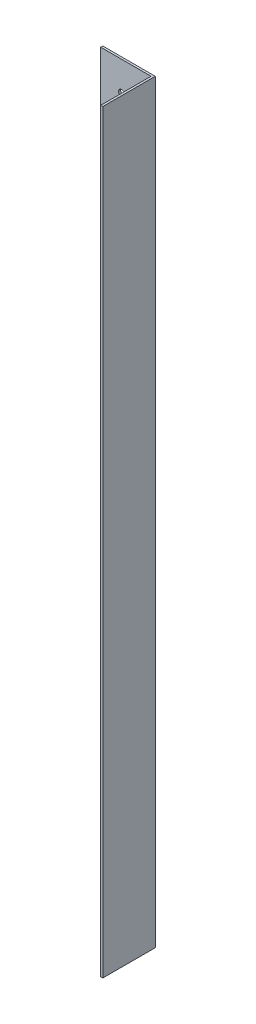
ISO-10303-21;
HEADER;
FILE_DESCRIPTION(('STEP AP214'),'2;1');
FILE_NAME('part.step','',(''),(''),'','','');
FILE_SCHEMA(('AUTOMOTIVE_DESIGN { 1 0 10303 214 1 1 1 1 }'));
ENDSEC;
DATA;
#1=APPLICATION_CONTEXT('core data for automotive mechanical design processes');
#2=APPLICATION_PROTOCOL_DEFINITION('international standard','automotive_design',2000,#1);
#3=PRODUCT_CONTEXT('',#1,'mechanical');
#4=PRODUCT('Part','Part','',(#3));
#5=PRODUCT_RELATED_PRODUCT_CATEGORY('part','',(#4));
#6=PRODUCT_DEFINITION_FORMATION('','',#4);
#7=PRODUCT_DEFINITION_CONTEXT('part definition',#1,'design');
#8=PRODUCT_DEFINITION('design','',#6,#7);
#9=PRODUCT_DEFINITION_SHAPE('','',#8);
#10=(LENGTH_UNIT() NAMED_UNIT(*) SI_UNIT(.MILLI.,.METRE.));
#11=(NAMED_UNIT(*) PLANE_ANGLE_UNIT() SI_UNIT($,.RADIAN.));
#12=(NAMED_UNIT(*) SI_UNIT($,.STERADIAN.) SOLID_ANGLE_UNIT());
#13=UNCERTAINTY_MEASURE_WITH_UNIT(LENGTH_MEASURE(1.E-05),#10,'distance_accuracy_value','');
#14=(GEOMETRIC_REPRESENTATION_CONTEXT(3) GLOBAL_UNCERTAINTY_ASSIGNED_CONTEXT((#13)) GLOBAL_UNIT_ASSIGNED_CONTEXT((#10,
#11,#12)) REPRESENTATION_CONTEXT('',''));
#15=CARTESIAN_POINT('',(0.,0.,0.));
#16=DIRECTION('',(0.,0.,1.));
#17=DIRECTION('',(1.,0.,0.));
#18=AXIS2_PLACEMENT_3D('',#15,#16,#17);
#19=CARTESIAN_POINT('',(0.,0.,1.));
#20=DIRECTION('',(0.,0.,1.));
#21=DIRECTION('',(1.,0.,0.));
#22=AXIS2_PLACEMENT_3D('',#19,#20,#21);
#23=PLANE('',#22);
#24=CARTESIAN_POINT('',(-43.4017250423012,12.4851945854484,1.));
#25=DIRECTION('',(0.,0.,1.));
#26=DIRECTION('',(1.,0.,0.));
#27=AXIS2_PLACEMENT_3D('',#24,#25,#26);
#28=CIRCLE('',#27,1.5);
#29=CARTESIAN_POINT('',(-41.9017250423012,12.4851945854484,1.));
#30=VERTEX_POINT('',#29);
#31=EDGE_CURVE('E97',#30,#30,#28,.T.);
#32=ORIENTED_EDGE('',*,*,#31,.F.);
#33=EDGE_LOOP('',(#32));
#34=FACE_BOUND('',#33,.T.);
#35=DIRECTION('',(0.,-1.,0.));
#36=VECTOR('',#35,1.);
#37=CARTESIAN_POINT('',(-53.4017250423012,26.4851945854484,1.));
#38=LINE('',#37,#36);
#39=CARTESIAN_POINT('',(-53.4017250423012,26.4851945854484,1.));
#40=VERTEX_POINT('',#39);
#41=CARTESIAN_POINT('',(-53.4017250423012,-333.514805414552,1.));
#42=VERTEX_POINT('',#41);
#43=EDGE_CURVE('E87',#40,#42,#38,.T.);
#44=ORIENTED_EDGE('',*,*,#43,.T.);
#45=DIRECTION('',(1.,0.,0.));
#46=VECTOR('',#45,1.);
#47=CARTESIAN_POINT('',(-53.4017250423012,-333.514805414552,1.));
#48=LINE('',#47,#46);
#49=CARTESIAN_POINT('',(-29.4017250423011,-333.514805414552,1.));
#50=VERTEX_POINT('',#49);
#51=EDGE_CURVE('E81',#42,#50,#48,.T.);
#52=ORIENTED_EDGE('',*,*,#51,.T.);
#53=DIRECTION('',(0.,1.,0.));
#54=VECTOR('',#53,1.);
#55=CARTESIAN_POINT('',(-29.4017250423012,26.4851945854484,1.));
#56=LINE('',#55,#54);
#57=CARTESIAN_POINT('',(-29.4017250423012,26.4851945854484,1.));
#58=VERTEX_POINT('',#57);
#59=EDGE_CURVE('E70',#50,#58,#56,.T.);
#60=ORIENTED_EDGE('',*,*,#59,.T.);
#61=DIRECTION('',(-1.,0.,0.));
#62=VECTOR('',#61,1.);
#63=CARTESIAN_POINT('',(-53.4017250423012,26.4851945854484,1.));
#64=LINE('',#63,#62);
#65=EDGE_CURVE('E50',#58,#40,#64,.T.);
#66=ORIENTED_EDGE('',*,*,#65,.T.);
#67=EDGE_LOOP('',(#44,#52,#60,#66));
#68=FACE_BOUND('',#67,.T.);
#69=CARTESIAN_POINT('',(-43.4017250423012,-319.514805414552,1.));
#70=DIRECTION('',(0.,0.,1.));
#71=DIRECTION('',(1.,0.,0.));
#72=AXIS2_PLACEMENT_3D('',#69,#70,#71);
#73=CIRCLE('',#72,1.5);
#74=CARTESIAN_POINT('',(-41.9017250423012,-319.514805414552,1.));
#75=VERTEX_POINT('',#74);
#76=EDGE_CURVE('E108',#75,#75,#73,.T.);
#77=ORIENTED_EDGE('',*,*,#76,.F.);
#78=EDGE_LOOP('',(#77));
#79=FACE_BOUND('',#78,.T.);
#80=ADVANCED_FACE('F33',(#34,#68,#79),#23,.T.);
#81=CARTESIAN_POINT('',(0.,0.,0.));
#82=DIRECTION('',(0.,0.,1.));
#83=DIRECTION('',(1.,0.,0.));
#84=AXIS2_PLACEMENT_3D('',#81,#82,#83);
#85=PLANE('',#84);
#86=DIRECTION('',(0.,-1.,0.));
#87=VECTOR('',#86,1.);
#88=CARTESIAN_POINT('',(-53.4017250423012,26.4851945854484,0.));
#89=LINE('',#88,#87);
#90=CARTESIAN_POINT('',(-53.4017250423012,26.4851945854484,0.));
#91=VERTEX_POINT('',#90);
#92=CARTESIAN_POINT('',(-53.4017250423012,-333.514805414552,0.));
#93=VERTEX_POINT('',#92);
#94=EDGE_CURVE('E95',#91,#93,#89,.T.);
#95=ORIENTED_EDGE('',*,*,#94,.F.);
#96=DIRECTION('',(-1.,0.,0.));
#97=VECTOR('',#96,1.);
#98=CARTESIAN_POINT('',(-53.4017250423012,26.4851945854484,0.));
#99=LINE('',#98,#97);
#100=CARTESIAN_POINT('',(-28.4017250423012,26.4851945854484,0.));
#101=VERTEX_POINT('',#100);
#102=EDGE_CURVE('E93',#101,#91,#99,.T.);
#103=ORIENTED_EDGE('',*,*,#102,.F.);
#104=DIRECTION('',(0.,1.,0.));
#105=VECTOR('',#104,1.);
#106=CARTESIAN_POINT('',(-28.4017250423012,26.4851945854484,0.));
#107=LINE('',#106,#105);
#108=CARTESIAN_POINT('',(-28.4017250423012,-333.514805414552,0.));
#109=VERTEX_POINT('',#108);
#110=EDGE_CURVE('E125',#109,#101,#107,.T.);
#111=ORIENTED_EDGE('',*,*,#110,.F.);
#112=DIRECTION('',(1.,0.,0.));
#113=VECTOR('',#112,1.);
#114=CARTESIAN_POINT('',(-53.4017250423012,-333.514805414552,0.));
#115=LINE('',#114,#113);
#116=EDGE_CURVE('E63',#93,#109,#115,.T.);
#117=ORIENTED_EDGE('',*,*,#116,.F.);
#118=EDGE_LOOP('',(#95,#103,#111,#117));
#119=FACE_BOUND('',#118,.T.);
#120=CARTESIAN_POINT('',(-43.4017250423012,12.4851945854484,0.));
#121=DIRECTION('',(0.,0.,1.));
#122=DIRECTION('',(1.,0.,0.));
#123=AXIS2_PLACEMENT_3D('',#120,#121,#122);
#124=CIRCLE('',#123,1.5);
#125=CARTESIAN_POINT('',(-41.9017250423012,12.4851945854484,0.));
#126=VERTEX_POINT('',#125);
#127=EDGE_CURVE('E101',#126,#126,#124,.T.);
#128=ORIENTED_EDGE('',*,*,#127,.T.);
#129=EDGE_LOOP('',(#128));
#130=FACE_BOUND('',#129,.T.);
#131=CARTESIAN_POINT('',(-43.4017250423012,-319.514805414552,0.));
#132=DIRECTION('',(0.,0.,1.));
#133=DIRECTION('',(1.,0.,0.));
#134=AXIS2_PLACEMENT_3D('',#131,#132,#133);
#135=CIRCLE('',#134,1.5);
#136=CARTESIAN_POINT('',(-41.9017250423012,-319.514805414552,0.));
#137=VERTEX_POINT('',#136);
#138=EDGE_CURVE('E110',#137,#137,#135,.T.);
#139=ORIENTED_EDGE('',*,*,#138,.T.);
#140=EDGE_LOOP('',(#139));
#141=FACE_BOUND('',#140,.T.);
#142=ADVANCED_FACE('F161',(#119,#130,#141),#85,.F.);
#143=CARTESIAN_POINT('',(-53.4017250423012,26.4851945854484,1.));
#144=DIRECTION('',(1.,0.,0.));
#145=DIRECTION('',(0.,1.,0.));
#146=AXIS2_PLACEMENT_3D('',#143,#144,#145);
#147=PLANE('',#146);
#148=ORIENTED_EDGE('',*,*,#94,.T.);
#149=DIRECTION('',(0.,0.,-1.));
#150=VECTOR('',#149,1.);
#151=CARTESIAN_POINT('',(-53.4017250423012,-333.514805414552,1.));
#152=LINE('',#151,#150);
#153=EDGE_CURVE('E11',#42,#93,#152,.T.);
#154=ORIENTED_EDGE('',*,*,#153,.F.);
#155=ORIENTED_EDGE('',*,*,#43,.F.);
#156=DIRECTION('',(0.,0.,-1.));
#157=VECTOR('',#156,1.);
#158=CARTESIAN_POINT('',(-53.4017250423012,26.4851945854484,1.));
#159=LINE('',#158,#157);
#160=EDGE_CURVE('E42',#40,#91,#159,.T.);
#161=ORIENTED_EDGE('',*,*,#160,.T.);
#162=EDGE_LOOP('',(#148,#154,#155,#161));
#163=FACE_BOUND('',#162,.T.);
#164=ADVANCED_FACE('F35',(#163),#147,.F.);
#165=CARTESIAN_POINT('',(-53.4017250423012,-333.514805414552,1.));
#166=DIRECTION('',(0.,1.,0.));
#167=DIRECTION('',(0.,0.,1.));
#168=AXIS2_PLACEMENT_3D('',#165,#166,#167);
#169=PLANE('',#168);
#170=ORIENTED_EDGE('',*,*,#116,.T.);
#171=DIRECTION('',(0.,0.,-1.));
#172=VECTOR('',#171,1.);
#173=CARTESIAN_POINT('',(-28.4017250423012,-333.514805414552,25.));
#174=LINE('',#173,#172);
#175=CARTESIAN_POINT('',(-28.4017250423012,-333.514805414552,25.));
#176=VERTEX_POINT('',#175);
#177=EDGE_CURVE('E116',#176,#109,#174,.T.);
#178=ORIENTED_EDGE('',*,*,#177,.F.);
#179=DIRECTION('',(1.,0.,0.));
#180=VECTOR('',#179,1.);
#181=CARTESIAN_POINT('',(-29.4017250423011,-333.514805414552,25.));
#182=LINE('',#181,#180);
#183=CARTESIAN_POINT('',(-29.4017250423011,-333.514805414552,25.));
#184=VERTEX_POINT('',#183);
#185=EDGE_CURVE('E133',#184,#176,#182,.T.);
#186=ORIENTED_EDGE('',*,*,#185,.F.);
#187=DIRECTION('',(0.,0.,-1.));
#188=VECTOR('',#187,1.);
#189=CARTESIAN_POINT('',(-29.4017250423011,-333.514805414552,25.));
#190=LINE('',#189,#188);
#191=EDGE_CURVE('E86',#184,#50,#190,.T.);
#192=ORIENTED_EDGE('',*,*,#191,.T.);
#193=ORIENTED_EDGE('',*,*,#51,.F.);
#194=ORIENTED_EDGE('',*,*,#153,.T.);
#195=EDGE_LOOP('',(#170,#178,#186,#192,#193,#194));
#196=FACE_BOUND('',#195,.T.);
#197=ADVANCED_FACE('F82',(#196),#169,.F.);
#198=CARTESIAN_POINT('',(-53.4017250423012,26.4851945854484,1.));
#199=DIRECTION('',(0.,-1.,0.));
#200=DIRECTION('',(0.,0.,-1.));
#201=AXIS2_PLACEMENT_3D('',#198,#199,#200);
#202=PLANE('',#201);
#203=ORIENTED_EDGE('',*,*,#102,.T.);
#204=ORIENTED_EDGE('',*,*,#160,.F.);
#205=ORIENTED_EDGE('',*,*,#65,.F.);
#206=DIRECTION('',(0.,0.,-1.));
#207=VECTOR('',#206,1.);
#208=CARTESIAN_POINT('',(-29.4017250423012,26.4851945854484,25.));
#209=LINE('',#208,#207);
#210=CARTESIAN_POINT('',(-29.4017250423012,26.4851945854484,25.));
#211=VERTEX_POINT('',#210);
#212=EDGE_CURVE('E122',#211,#58,#209,.T.);
#213=ORIENTED_EDGE('',*,*,#212,.F.);
#214=DIRECTION('',(-1.,0.,0.));
#215=VECTOR('',#214,1.);
#216=CARTESIAN_POINT('',(-29.4017250423012,26.4851945854484,25.));
#217=LINE('',#216,#215);
#218=CARTESIAN_POINT('',(-28.4017250423012,26.4851945854484,25.));
#219=VERTEX_POINT('',#218);
#220=EDGE_CURVE('E124',#219,#211,#217,.T.);
#221=ORIENTED_EDGE('',*,*,#220,.F.);
#222=DIRECTION('',(0.,0.,-1.));
#223=VECTOR('',#222,1.);
#224=CARTESIAN_POINT('',(-28.4017250423012,26.4851945854484,25.));
#225=LINE('',#224,#223);
#226=EDGE_CURVE('E119',#219,#101,#225,.T.);
#227=ORIENTED_EDGE('',*,*,#226,.T.);
#228=EDGE_LOOP('',(#203,#204,#205,#213,#221,#227));
#229=FACE_BOUND('',#228,.T.);
#230=ADVANCED_FACE('F171',(#229),#202,.F.);
#231=CARTESIAN_POINT('',(-43.4017250423012,12.4851945854484,1.));
#232=DIRECTION('',(0.,0.,-1.));
#233=DIRECTION('',(-1.,0.,0.));
#234=AXIS2_PLACEMENT_3D('',#231,#232,#233);
#235=CYLINDRICAL_SURFACE('',#234,1.5);
#236=ORIENTED_EDGE('',*,*,#31,.T.);
#237=EDGE_LOOP('',(#236));
#238=FACE_BOUND('',#237,.T.);
#239=ORIENTED_EDGE('',*,*,#127,.F.);
#240=EDGE_LOOP('',(#239));
#241=FACE_BOUND('',#240,.T.);
#242=ADVANCED_FACE('F157',(#238,#241),#235,.F.);
#243=CARTESIAN_POINT('',(-43.4017250423012,-319.514805414552,1.));
#244=DIRECTION('',(0.,0.,-1.));
#245=DIRECTION('',(-1.,0.,0.));
#246=AXIS2_PLACEMENT_3D('',#243,#244,#245);
#247=CYLINDRICAL_SURFACE('',#246,1.5);
#248=ORIENTED_EDGE('',*,*,#76,.T.);
#249=EDGE_LOOP('',(#248));
#250=FACE_BOUND('',#249,.T.);
#251=ORIENTED_EDGE('',*,*,#138,.F.);
#252=EDGE_LOOP('',(#251));
#253=FACE_BOUND('',#252,.T.);
#254=ADVANCED_FACE('F149',(#250,#253),#247,.F.);
#255=CARTESIAN_POINT('',(-29.4017250423012,26.4851945854484,25.));
#256=DIRECTION('',(1.,0.,0.));
#257=DIRECTION('',(0.,1.,0.));
#258=AXIS2_PLACEMENT_3D('',#255,#256,#257);
#259=PLANE('',#258);
#260=ORIENTED_EDGE('',*,*,#59,.F.);
#261=ORIENTED_EDGE('',*,*,#191,.F.);
#262=DIRECTION('',(0.,-1.,0.));
#263=VECTOR('',#262,1.);
#264=CARTESIAN_POINT('',(-29.4017250423012,26.4851945854484,25.));
#265=LINE('',#264,#263);
#266=EDGE_CURVE('E128',#211,#184,#265,.T.);
#267=ORIENTED_EDGE('',*,*,#266,.F.);
#268=ORIENTED_EDGE('',*,*,#212,.T.);
#269=EDGE_LOOP('',(#260,#261,#267,#268));
#270=FACE_BOUND('',#269,.T.);
#271=ADVANCED_FACE('F146',(#270),#259,.F.);
#272=CARTESIAN_POINT('',(-28.4017250423012,26.4851945854484,25.));
#273=DIRECTION('',(-1.,0.,0.));
#274=DIRECTION('',(0.,-1.,0.));
#275=AXIS2_PLACEMENT_3D('',#272,#273,#274);
#276=PLANE('',#275);
#277=ORIENTED_EDGE('',*,*,#110,.T.);
#278=ORIENTED_EDGE('',*,*,#226,.F.);
#279=DIRECTION('',(0.,1.,0.));
#280=VECTOR('',#279,1.);
#281=CARTESIAN_POINT('',(-28.4017250423012,26.4851945854484,25.));
#282=LINE('',#281,#280);
#283=EDGE_CURVE('E130',#176,#219,#282,.T.);
#284=ORIENTED_EDGE('',*,*,#283,.F.);
#285=ORIENTED_EDGE('',*,*,#177,.T.);
#286=EDGE_LOOP('',(#277,#278,#284,#285));
#287=FACE_BOUND('',#286,.T.);
#288=ADVANCED_FACE('F148',(#287),#276,.F.);
#289=CARTESIAN_POINT('',(0.,0.,25.));
#290=DIRECTION('',(0.,0.,1.));
#291=DIRECTION('',(1.,0.,0.));
#292=AXIS2_PLACEMENT_3D('',#289,#290,#291);
#293=PLANE('',#292);
#294=ORIENTED_EDGE('',*,*,#266,.T.);
#295=ORIENTED_EDGE('',*,*,#185,.T.);
#296=ORIENTED_EDGE('',*,*,#283,.T.);
#297=ORIENTED_EDGE('',*,*,#220,.T.);
#298=EDGE_LOOP('',(#294,#295,#296,#297));
#299=FACE_BOUND('',#298,.T.);
#300=ADVANCED_FACE('F140',(#299),#293,.T.);
#301=CLOSED_SHELL('',(#80,#142,#164,#197,#230,#242,#254,#271,#288,#300));
#302=MANIFOLD_SOLID_BREP('B2',#301);
#303=ADVANCED_BREP_SHAPE_REPRESENTATION('',(#18,#302),#14);
#304=SHAPE_DEFINITION_REPRESENTATION(#9,#303);
ENDSEC;
END-ISO-10303-21;
